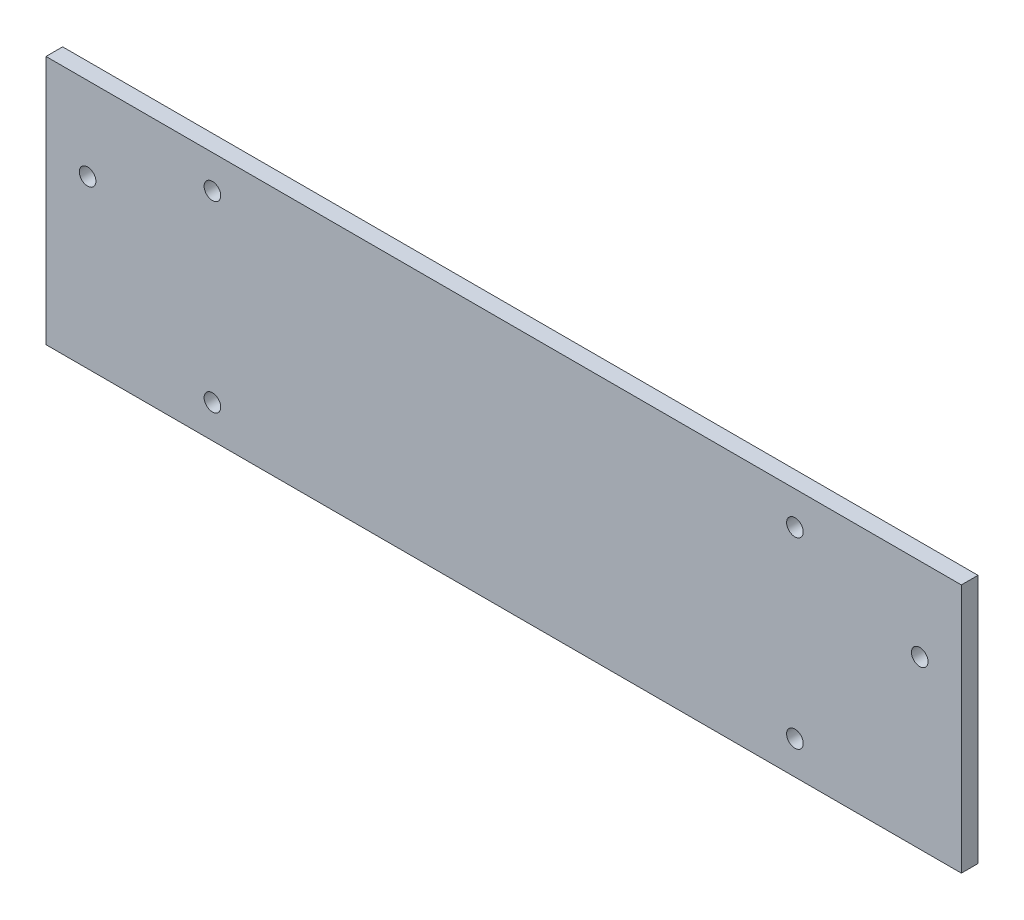
ISO-10303-21;
HEADER;
FILE_DESCRIPTION(('STEP AP214'),'2;1');
FILE_NAME('part.step','',(''),(''),'','','');
FILE_SCHEMA(('AUTOMOTIVE_DESIGN { 1 0 10303 214 1 1 1 1 }'));
ENDSEC;
DATA;
#1=APPLICATION_CONTEXT('core data for automotive mechanical design processes');
#2=APPLICATION_PROTOCOL_DEFINITION('international standard','automotive_design',2000,#1);
#3=PRODUCT_CONTEXT('',#1,'mechanical');
#4=PRODUCT('Part','Part','',(#3));
#5=PRODUCT_RELATED_PRODUCT_CATEGORY('part','',(#4));
#6=PRODUCT_DEFINITION_FORMATION('','',#4);
#7=PRODUCT_DEFINITION_CONTEXT('part definition',#1,'design');
#8=PRODUCT_DEFINITION('design','',#6,#7);
#9=PRODUCT_DEFINITION_SHAPE('','',#8);
#10=(LENGTH_UNIT() NAMED_UNIT(*) SI_UNIT(.MILLI.,.METRE.));
#11=(NAMED_UNIT(*) PLANE_ANGLE_UNIT() SI_UNIT($,.RADIAN.));
#12=(NAMED_UNIT(*) SI_UNIT($,.STERADIAN.) SOLID_ANGLE_UNIT());
#13=UNCERTAINTY_MEASURE_WITH_UNIT(LENGTH_MEASURE(1.E-05),#10,'distance_accuracy_value','');
#14=(GEOMETRIC_REPRESENTATION_CONTEXT(3) GLOBAL_UNCERTAINTY_ASSIGNED_CONTEXT((#13)) GLOBAL_UNIT_ASSIGNED_CONTEXT((#10,
#11,#12)) REPRESENTATION_CONTEXT('',''));
#15=CARTESIAN_POINT('',(0.,0.,0.));
#16=DIRECTION('',(0.,0.,1.));
#17=DIRECTION('',(1.,0.,0.));
#18=AXIS2_PLACEMENT_3D('',#15,#16,#17);
#19=CARTESIAN_POINT('',(-167.64,22.3287581699346,5.08));
#20=DIRECTION('',(1.,0.,0.));
#21=DIRECTION('',(0.,0.,-1.));
#22=AXIS2_PLACEMENT_3D('',#19,#20,#21);
#23=PLANE('',#22);
#24=DIRECTION('',(0.,-1.,0.));
#25=VECTOR('',#24,1.);
#26=CARTESIAN_POINT('',(-167.64,22.3287581699346,0.));
#27=LINE('',#26,#25);
#28=CARTESIAN_POINT('',(-167.64,22.3287581699346,0.));
#29=VERTEX_POINT('',#28);
#30=CARTESIAN_POINT('',(-167.64,-53.8712418300654,0.));
#31=VERTEX_POINT('',#30);
#32=EDGE_CURVE('E99',#29,#31,#27,.T.);
#33=ORIENTED_EDGE('',*,*,#32,.T.);
#34=DIRECTION('',(0.,0.,-1.));
#35=VECTOR('',#34,1.);
#36=CARTESIAN_POINT('',(-167.64,-53.8712418300654,5.08));
#37=LINE('',#36,#35);
#38=CARTESIAN_POINT('',(-167.64,-53.8712418300654,5.08));
#39=VERTEX_POINT('',#38);
#40=EDGE_CURVE('E11',#39,#31,#37,.T.);
#41=ORIENTED_EDGE('',*,*,#40,.F.);
#42=DIRECTION('',(0.,-1.,0.));
#43=VECTOR('',#42,1.);
#44=CARTESIAN_POINT('',(-167.64,22.3287581699346,5.08));
#45=LINE('',#44,#43);
#46=CARTESIAN_POINT('',(-167.64,22.3287581699346,5.08));
#47=VERTEX_POINT('',#46);
#48=EDGE_CURVE('E86',#47,#39,#45,.T.);
#49=ORIENTED_EDGE('',*,*,#48,.F.);
#50=DIRECTION('',(0.,0.,-1.));
#51=VECTOR('',#50,1.);
#52=CARTESIAN_POINT('',(-167.64,22.3287581699346,5.08));
#53=LINE('',#52,#51);
#54=EDGE_CURVE('E95',#47,#29,#53,.T.);
#55=ORIENTED_EDGE('',*,*,#54,.T.);
#56=EDGE_LOOP('',(#33,#41,#49,#55));
#57=FACE_BOUND('',#56,.T.);
#58=ADVANCED_FACE('F33',(#57),#23,.F.);
#59=CARTESIAN_POINT('',(-167.64,-53.8712418300654,5.08));
#60=DIRECTION('',(0.,1.,0.));
#61=DIRECTION('',(0.,0.,1.));
#62=AXIS2_PLACEMENT_3D('',#59,#60,#61);
#63=PLANE('',#62);
#64=DIRECTION('',(1.,0.,0.));
#65=VECTOR('',#64,1.);
#66=CARTESIAN_POINT('',(-167.64,-53.8712418300654,0.));
#67=LINE('',#66,#65);
#68=CARTESIAN_POINT('',(111.76,-53.8712418300654,0.));
#69=VERTEX_POINT('',#68);
#70=EDGE_CURVE('E90',#31,#69,#67,.T.);
#71=ORIENTED_EDGE('',*,*,#70,.T.);
#72=DIRECTION('',(0.,0.,-1.));
#73=VECTOR('',#72,1.);
#74=CARTESIAN_POINT('',(111.76,-53.8712418300654,5.08));
#75=LINE('',#74,#73);
#76=CARTESIAN_POINT('',(111.76,-53.8712418300654,5.08));
#77=VERTEX_POINT('',#76);
#78=EDGE_CURVE('E42',#77,#69,#75,.T.);
#79=ORIENTED_EDGE('',*,*,#78,.F.);
#80=DIRECTION('',(1.,0.,0.));
#81=VECTOR('',#80,1.);
#82=CARTESIAN_POINT('',(-167.64,-53.8712418300654,5.08));
#83=LINE('',#82,#81);
#84=EDGE_CURVE('E81',#39,#77,#83,.T.);
#85=ORIENTED_EDGE('',*,*,#84,.F.);
#86=ORIENTED_EDGE('',*,*,#40,.T.);
#87=EDGE_LOOP('',(#71,#79,#85,#86));
#88=FACE_BOUND('',#87,.T.);
#89=ADVANCED_FACE('F89',(#88),#63,.F.);
#90=CARTESIAN_POINT('',(111.76,22.3287581699346,5.08));
#91=DIRECTION('',(-1.,0.,0.));
#92=DIRECTION('',(0.,-1.,0.));
#93=AXIS2_PLACEMENT_3D('',#90,#91,#92);
#94=PLANE('',#93);
#95=DIRECTION('',(0.,1.,0.));
#96=VECTOR('',#95,1.);
#97=CARTESIAN_POINT('',(111.76,22.3287581699346,0.));
#98=LINE('',#97,#96);
#99=CARTESIAN_POINT('',(111.76,22.3287581699346,0.));
#100=VERTEX_POINT('',#99);
#101=EDGE_CURVE('E68',#69,#100,#98,.T.);
#102=ORIENTED_EDGE('',*,*,#101,.T.);
#103=DIRECTION('',(0.,0.,-1.));
#104=VECTOR('',#103,1.);
#105=CARTESIAN_POINT('',(111.76,22.3287581699346,5.08));
#106=LINE('',#105,#104);
#107=CARTESIAN_POINT('',(111.76,22.3287581699346,5.08));
#108=VERTEX_POINT('',#107);
#109=EDGE_CURVE('E91',#108,#100,#106,.T.);
#110=ORIENTED_EDGE('',*,*,#109,.F.);
#111=DIRECTION('',(0.,1.,0.));
#112=VECTOR('',#111,1.);
#113=CARTESIAN_POINT('',(111.76,22.3287581699346,5.08));
#114=LINE('',#113,#112);
#115=EDGE_CURVE('E84',#77,#108,#114,.T.);
#116=ORIENTED_EDGE('',*,*,#115,.F.);
#117=ORIENTED_EDGE('',*,*,#78,.T.);
#118=EDGE_LOOP('',(#102,#110,#116,#117));
#119=FACE_BOUND('',#118,.T.);
#120=ADVANCED_FACE('F93',(#119),#94,.F.);
#121=CARTESIAN_POINT('',(-167.64,22.3287581699346,5.08));
#122=DIRECTION('',(0.,-1.,0.));
#123=DIRECTION('',(0.,0.,-1.));
#124=AXIS2_PLACEMENT_3D('',#121,#122,#123);
#125=PLANE('',#124);
#126=DIRECTION('',(-1.,0.,0.));
#127=VECTOR('',#126,1.);
#128=CARTESIAN_POINT('',(-167.64,22.3287581699346,0.));
#129=LINE('',#128,#127);
#130=EDGE_CURVE('E74',#100,#29,#129,.T.);
#131=ORIENTED_EDGE('',*,*,#130,.T.);
#132=ORIENTED_EDGE('',*,*,#54,.F.);
#133=DIRECTION('',(-1.,0.,0.));
#134=VECTOR('',#133,1.);
#135=CARTESIAN_POINT('',(-167.64,22.3287581699346,5.08));
#136=LINE('',#135,#134);
#137=EDGE_CURVE('E51',#108,#47,#136,.T.);
#138=ORIENTED_EDGE('',*,*,#137,.F.);
#139=ORIENTED_EDGE('',*,*,#109,.T.);
#140=EDGE_LOOP('',(#131,#132,#138,#139));
#141=FACE_BOUND('',#140,.T.);
#142=ADVANCED_FACE('F157',(#141),#125,.F.);
#143=CARTESIAN_POINT('',(0.,0.,5.08));
#144=DIRECTION('',(0.,0.,1.));
#145=DIRECTION('',(1.,0.,0.));
#146=AXIS2_PLACEMENT_3D('',#143,#144,#145);
#147=PLANE('',#146);
#148=CARTESIAN_POINT('',(-154.94,-3.07124183006537,5.08));
#149=DIRECTION('',(0.,0.,1.));
#150=DIRECTION('',(1.,0.,0.));
#151=AXIS2_PLACEMENT_3D('',#148,#149,#150);
#152=CIRCLE('',#151,2.53999999999998);
#153=CARTESIAN_POINT('',(-152.4,-3.07124183006537,5.08));
#154=VERTEX_POINT('',#153);
#155=EDGE_CURVE('E111',#154,#154,#152,.T.);
#156=ORIENTED_EDGE('',*,*,#155,.F.);
#157=EDGE_LOOP('',(#156));
#158=FACE_BOUND('',#157,.T.);
#159=CARTESIAN_POINT('',(-116.84,12.1687581699346,5.08));
#160=DIRECTION('',(0.,0.,1.));
#161=DIRECTION('',(1.,0.,0.));
#162=AXIS2_PLACEMENT_3D('',#159,#160,#161);
#163=CIRCLE('',#162,2.54);
#164=CARTESIAN_POINT('',(-114.3,12.1687581699346,5.08));
#165=VERTEX_POINT('',#164);
#166=EDGE_CURVE('E244',#165,#165,#163,.T.);
#167=ORIENTED_EDGE('',*,*,#166,.F.);
#168=EDGE_LOOP('',(#167));
#169=FACE_BOUND('',#168,.T.);
#170=CARTESIAN_POINT('',(-116.84,-43.7112418300654,5.08));
#171=DIRECTION('',(0.,0.,1.));
#172=DIRECTION('',(1.,0.,0.));
#173=AXIS2_PLACEMENT_3D('',#170,#171,#172);
#174=CIRCLE('',#173,2.54);
#175=CARTESIAN_POINT('',(-114.3,-43.7112418300654,5.08));
#176=VERTEX_POINT('',#175);
#177=EDGE_CURVE('E231',#176,#176,#174,.T.);
#178=ORIENTED_EDGE('',*,*,#177,.F.);
#179=EDGE_LOOP('',(#178));
#180=FACE_BOUND('',#179,.T.);
#181=CARTESIAN_POINT('',(60.9599999999999,-43.7112418300654,5.08));
#182=DIRECTION('',(0.,0.,1.));
#183=DIRECTION('',(1.,0.,0.));
#184=AXIS2_PLACEMENT_3D('',#181,#182,#183);
#185=CIRCLE('',#184,2.54);
#186=CARTESIAN_POINT('',(63.4999999999999,-43.7112418300654,5.08));
#187=VERTEX_POINT('',#186);
#188=EDGE_CURVE('E245',#187,#187,#185,.T.);
#189=ORIENTED_EDGE('',*,*,#188,.F.);
#190=EDGE_LOOP('',(#189));
#191=FACE_BOUND('',#190,.T.);
#192=CARTESIAN_POINT('',(60.9599999999999,12.1687581699346,5.08));
#193=DIRECTION('',(0.,0.,1.));
#194=DIRECTION('',(1.,0.,0.));
#195=AXIS2_PLACEMENT_3D('',#192,#193,#194);
#196=CIRCLE('',#195,2.54);
#197=CARTESIAN_POINT('',(63.4999999999999,12.1687581699346,5.08));
#198=VERTEX_POINT('',#197);
#199=EDGE_CURVE('E250',#198,#198,#196,.T.);
#200=ORIENTED_EDGE('',*,*,#199,.F.);
#201=EDGE_LOOP('',(#200));
#202=FACE_BOUND('',#201,.T.);
#203=CARTESIAN_POINT('',(99.0599999999999,-3.07124183006537,5.08));
#204=DIRECTION('',(0.,0.,1.));
#205=DIRECTION('',(1.,0.,0.));
#206=AXIS2_PLACEMENT_3D('',#203,#204,#205);
#207=CIRCLE('',#206,2.54);
#208=CARTESIAN_POINT('',(101.6,-3.07124183006537,5.08));
#209=VERTEX_POINT('',#208);
#210=EDGE_CURVE('E256',#209,#209,#207,.T.);
#211=ORIENTED_EDGE('',*,*,#210,.F.);
#212=EDGE_LOOP('',(#211));
#213=FACE_BOUND('',#212,.T.);
#214=ORIENTED_EDGE('',*,*,#48,.T.);
#215=ORIENTED_EDGE('',*,*,#84,.T.);
#216=ORIENTED_EDGE('',*,*,#115,.T.);
#217=ORIENTED_EDGE('',*,*,#137,.T.);
#218=EDGE_LOOP('',(#214,#215,#216,#217));
#219=FACE_BOUND('',#218,.T.);
#220=ADVANCED_FACE('F82',(#158,#169,#180,#191,#202,#213,#219),#147,.T.);
#221=CARTESIAN_POINT('',(0.,0.,0.));
#222=DIRECTION('',(0.,0.,1.));
#223=DIRECTION('',(1.,0.,0.));
#224=AXIS2_PLACEMENT_3D('',#221,#222,#223);
#225=PLANE('',#224);
#226=CARTESIAN_POINT('',(-154.94,-3.07124183006537,0.));
#227=DIRECTION('',(0.,0.,1.));
#228=DIRECTION('',(1.,0.,0.));
#229=AXIS2_PLACEMENT_3D('',#226,#227,#228);
#230=CIRCLE('',#229,2.53999999999998);
#231=CARTESIAN_POINT('',(-152.4,-3.07124183006537,0.));
#232=VERTEX_POINT('',#231);
#233=EDGE_CURVE('E36',#232,#232,#230,.T.);
#234=ORIENTED_EDGE('',*,*,#233,.T.);
#235=EDGE_LOOP('',(#234));
#236=FACE_BOUND('',#235,.T.);
#237=CARTESIAN_POINT('',(-116.84,12.1687581699346,0.));
#238=DIRECTION('',(0.,0.,1.));
#239=DIRECTION('',(1.,0.,0.));
#240=AXIS2_PLACEMENT_3D('',#237,#238,#239);
#241=CIRCLE('',#240,2.54);
#242=CARTESIAN_POINT('',(-114.3,12.1687581699346,0.));
#243=VERTEX_POINT('',#242);
#244=EDGE_CURVE('E119',#243,#243,#241,.T.);
#245=ORIENTED_EDGE('',*,*,#244,.T.);
#246=EDGE_LOOP('',(#245));
#247=FACE_BOUND('',#246,.T.);
#248=CARTESIAN_POINT('',(-116.84,-43.7112418300654,0.));
#249=DIRECTION('',(0.,0.,1.));
#250=DIRECTION('',(1.,0.,0.));
#251=AXIS2_PLACEMENT_3D('',#248,#249,#250);
#252=CIRCLE('',#251,2.54);
#253=CARTESIAN_POINT('',(-114.3,-43.7112418300654,0.));
#254=VERTEX_POINT('',#253);
#255=EDGE_CURVE('E117',#254,#254,#252,.T.);
#256=ORIENTED_EDGE('',*,*,#255,.T.);
#257=EDGE_LOOP('',(#256));
#258=FACE_BOUND('',#257,.T.);
#259=CARTESIAN_POINT('',(60.9599999999999,-43.7112418300654,0.));
#260=DIRECTION('',(0.,0.,1.));
#261=DIRECTION('',(1.,0.,0.));
#262=AXIS2_PLACEMENT_3D('',#259,#260,#261);
#263=CIRCLE('',#262,2.54);
#264=CARTESIAN_POINT('',(63.4999999999999,-43.7112418300654,0.));
#265=VERTEX_POINT('',#264);
#266=EDGE_CURVE('E114',#265,#265,#263,.T.);
#267=ORIENTED_EDGE('',*,*,#266,.T.);
#268=EDGE_LOOP('',(#267));
#269=FACE_BOUND('',#268,.T.);
#270=CARTESIAN_POINT('',(60.9599999999999,12.1687581699346,0.));
#271=DIRECTION('',(0.,0.,1.));
#272=DIRECTION('',(1.,0.,0.));
#273=AXIS2_PLACEMENT_3D('',#270,#271,#272);
#274=CIRCLE('',#273,2.54);
#275=CARTESIAN_POINT('',(63.4999999999999,12.1687581699346,0.));
#276=VERTEX_POINT('',#275);
#277=EDGE_CURVE('E110',#276,#276,#274,.T.);
#278=ORIENTED_EDGE('',*,*,#277,.T.);
#279=EDGE_LOOP('',(#278));
#280=FACE_BOUND('',#279,.T.);
#281=CARTESIAN_POINT('',(99.0599999999999,-3.07124183006537,0.));
#282=DIRECTION('',(0.,0.,1.));
#283=DIRECTION('',(1.,0.,0.));
#284=AXIS2_PLACEMENT_3D('',#281,#282,#283);
#285=CIRCLE('',#284,2.54);
#286=CARTESIAN_POINT('',(101.6,-3.07124183006537,0.));
#287=VERTEX_POINT('',#286);
#288=EDGE_CURVE('E107',#287,#287,#285,.T.);
#289=ORIENTED_EDGE('',*,*,#288,.T.);
#290=EDGE_LOOP('',(#289));
#291=FACE_BOUND('',#290,.T.);
#292=ORIENTED_EDGE('',*,*,#32,.F.);
#293=ORIENTED_EDGE('',*,*,#130,.F.);
#294=ORIENTED_EDGE('',*,*,#101,.F.);
#295=ORIENTED_EDGE('',*,*,#70,.F.);
#296=EDGE_LOOP('',(#292,#293,#294,#295));
#297=FACE_BOUND('',#296,.T.);
#298=ADVANCED_FACE('F126',(#236,#247,#258,#269,#280,#291,#297),#225,.F.);
#299=CARTESIAN_POINT('',(99.0599999999999,-3.07124183006537,-7.62));
#300=DIRECTION('',(0.,0.,1.));
#301=DIRECTION('',(1.,0.,0.));
#302=AXIS2_PLACEMENT_3D('',#299,#300,#301);
#303=CYLINDRICAL_SURFACE('',#302,2.54);
#304=ORIENTED_EDGE('',*,*,#210,.T.);
#305=EDGE_LOOP('',(#304));
#306=FACE_BOUND('',#305,.T.);
#307=ORIENTED_EDGE('',*,*,#288,.F.);
#308=EDGE_LOOP('',(#307));
#309=FACE_BOUND('',#308,.T.);
#310=ADVANCED_FACE('F148',(#306,#309),#303,.F.);
#311=CARTESIAN_POINT('',(60.9599999999999,12.1687581699346,-7.62));
#312=DIRECTION('',(0.,0.,1.));
#313=DIRECTION('',(1.,0.,0.));
#314=AXIS2_PLACEMENT_3D('',#311,#312,#313);
#315=CYLINDRICAL_SURFACE('',#314,2.54);
#316=ORIENTED_EDGE('',*,*,#199,.T.);
#317=EDGE_LOOP('',(#316));
#318=FACE_BOUND('',#317,.T.);
#319=ORIENTED_EDGE('',*,*,#277,.F.);
#320=EDGE_LOOP('',(#319));
#321=FACE_BOUND('',#320,.T.);
#322=ADVANCED_FACE('F154',(#318,#321),#315,.F.);
#323=CARTESIAN_POINT('',(60.9599999999999,-43.7112418300654,-7.62));
#324=DIRECTION('',(0.,0.,1.));
#325=DIRECTION('',(1.,0.,0.));
#326=AXIS2_PLACEMENT_3D('',#323,#324,#325);
#327=CYLINDRICAL_SURFACE('',#326,2.54);
#328=ORIENTED_EDGE('',*,*,#188,.T.);
#329=EDGE_LOOP('',(#328));
#330=FACE_BOUND('',#329,.T.);
#331=ORIENTED_EDGE('',*,*,#266,.F.);
#332=EDGE_LOOP('',(#331));
#333=FACE_BOUND('',#332,.T.);
#334=ADVANCED_FACE('F195',(#330,#333),#327,.F.);
#335=CARTESIAN_POINT('',(-116.84,-43.7112418300654,-7.62));
#336=DIRECTION('',(0.,0.,1.));
#337=DIRECTION('',(1.,0.,0.));
#338=AXIS2_PLACEMENT_3D('',#335,#336,#337);
#339=CYLINDRICAL_SURFACE('',#338,2.54);
#340=ORIENTED_EDGE('',*,*,#177,.T.);
#341=EDGE_LOOP('',(#340));
#342=FACE_BOUND('',#341,.T.);
#343=ORIENTED_EDGE('',*,*,#255,.F.);
#344=EDGE_LOOP('',(#343));
#345=FACE_BOUND('',#344,.T.);
#346=ADVANCED_FACE('F136',(#342,#345),#339,.F.);
#347=CARTESIAN_POINT('',(-116.84,12.1687581699346,-7.62));
#348=DIRECTION('',(0.,0.,1.));
#349=DIRECTION('',(1.,0.,0.));
#350=AXIS2_PLACEMENT_3D('',#347,#348,#349);
#351=CYLINDRICAL_SURFACE('',#350,2.54);
#352=ORIENTED_EDGE('',*,*,#166,.T.);
#353=EDGE_LOOP('',(#352));
#354=FACE_BOUND('',#353,.T.);
#355=ORIENTED_EDGE('',*,*,#244,.F.);
#356=EDGE_LOOP('',(#355));
#357=FACE_BOUND('',#356,.T.);
#358=ADVANCED_FACE('F130',(#354,#357),#351,.F.);
#359=CARTESIAN_POINT('',(-154.94,-3.07124183006537,-7.62));
#360=DIRECTION('',(0.,0.,1.));
#361=DIRECTION('',(1.,0.,0.));
#362=AXIS2_PLACEMENT_3D('',#359,#360,#361);
#363=CYLINDRICAL_SURFACE('',#362,2.53999999999998);
#364=ORIENTED_EDGE('',*,*,#155,.T.);
#365=EDGE_LOOP('',(#364));
#366=FACE_BOUND('',#365,.T.);
#367=ORIENTED_EDGE('',*,*,#233,.F.);
#368=EDGE_LOOP('',(#367));
#369=FACE_BOUND('',#368,.T.);
#370=ADVANCED_FACE('F128',(#366,#369),#363,.F.);
#371=CLOSED_SHELL('',(#58,#89,#120,#142,#220,#298,#310,#322,#334,#346,#358,#370));
#372=MANIFOLD_SOLID_BREP('B2',#371);
#373=ADVANCED_BREP_SHAPE_REPRESENTATION('',(#18,#372),#14);
#374=SHAPE_DEFINITION_REPRESENTATION(#9,#373);
ENDSEC;
END-ISO-10303-21;
